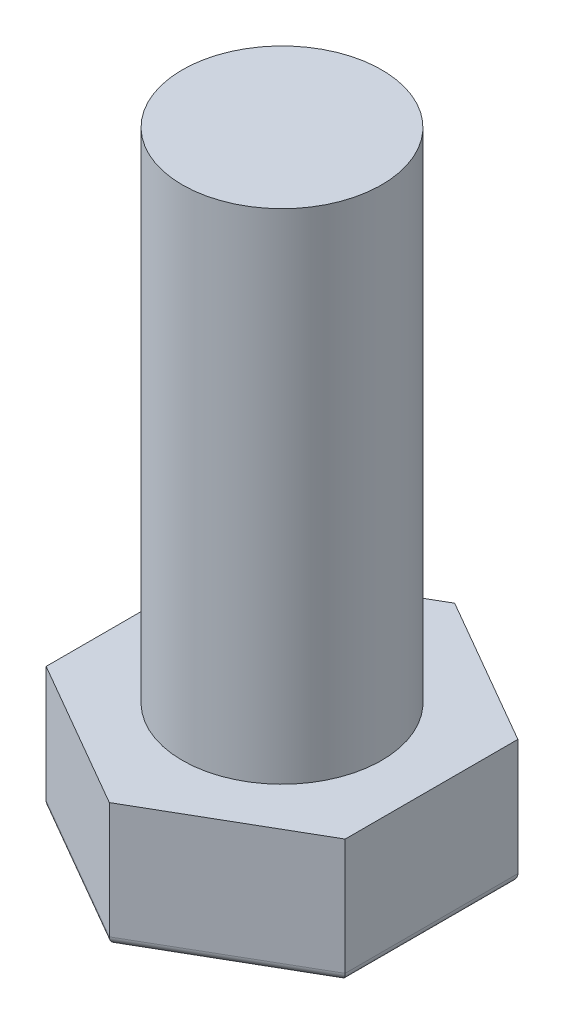
ISO-10303-21;
HEADER;
FILE_DESCRIPTION(('STEP AP214'),'2;1');
FILE_NAME('part.step','',(''),(''),'','','');
FILE_SCHEMA(('AUTOMOTIVE_DESIGN { 1 0 10303 214 1 1 1 1 }'));
ENDSEC;
DATA;
#1=APPLICATION_CONTEXT('core data for automotive mechanical design processes');
#2=APPLICATION_PROTOCOL_DEFINITION('international standard','automotive_design',2000,#1);
#3=PRODUCT_CONTEXT('',#1,'mechanical');
#4=PRODUCT('Part','Part','',(#3));
#5=PRODUCT_RELATED_PRODUCT_CATEGORY('part','',(#4));
#6=PRODUCT_DEFINITION_FORMATION('','',#4);
#7=PRODUCT_DEFINITION_CONTEXT('part definition',#1,'design');
#8=PRODUCT_DEFINITION('design','',#6,#7);
#9=PRODUCT_DEFINITION_SHAPE('','',#8);
#10=(LENGTH_UNIT() NAMED_UNIT(*) SI_UNIT(.MILLI.,.METRE.));
#11=(NAMED_UNIT(*) PLANE_ANGLE_UNIT() SI_UNIT($,.RADIAN.));
#12=(NAMED_UNIT(*) SI_UNIT($,.STERADIAN.) SOLID_ANGLE_UNIT());
#13=UNCERTAINTY_MEASURE_WITH_UNIT(LENGTH_MEASURE(1.E-05),#10,'distance_accuracy_value','');
#14=(GEOMETRIC_REPRESENTATION_CONTEXT(3) GLOBAL_UNCERTAINTY_ASSIGNED_CONTEXT((#13)) GLOBAL_UNIT_ASSIGNED_CONTEXT((#10,
#11,#12)) REPRESENTATION_CONTEXT('',''));
#15=CARTESIAN_POINT('',(0.,0.,0.));
#16=DIRECTION('',(0.,0.,1.));
#17=DIRECTION('',(1.,0.,0.));
#18=AXIS2_PLACEMENT_3D('',#15,#16,#17);
#19=CARTESIAN_POINT('',(18.,15.,-10.3923048454133));
#20=DIRECTION('',(-0.5,0.,0.866025403784439));
#21=DIRECTION('',(0.866025403784439,0.,0.5));
#22=AXIS2_PLACEMENT_3D('',#19,#20,#21);
#23=PLANE('',#22);
#24=DIRECTION('',(0.,-1.,0.));
#25=VECTOR('',#24,1.);
#26=CARTESIAN_POINT('',(18.,15.,-10.3923048454133));
#27=LINE('',#26,#25);
#28=CARTESIAN_POINT('',(18.,15.,-10.3923048454133));
#29=VERTEX_POINT('',#28);
#30=CARTESIAN_POINT('',(18.,1.,-10.3923048454133));
#31=VERTEX_POINT('',#30);
#32=EDGE_CURVE('E224',#29,#31,#27,.T.);
#33=ORIENTED_EDGE('',*,*,#32,.T.);
#34=DIRECTION('',(-0.866025403784439,0.,-0.5));
#35=VECTOR('',#34,1.);
#36=CARTESIAN_POINT('',(18.,1.,-10.3923048454133));
#37=LINE('',#36,#35);
#38=CARTESIAN_POINT('',(0.,1.,-20.7846096908265));
#39=VERTEX_POINT('',#38);
#40=EDGE_CURVE('E11',#31,#39,#37,.T.);
#41=ORIENTED_EDGE('',*,*,#40,.T.);
#42=DIRECTION('',(0.,-1.,0.));
#43=VECTOR('',#42,1.);
#44=CARTESIAN_POINT('',(0.,15.,-20.7846096908265));
#45=LINE('',#44,#43);
#46=CARTESIAN_POINT('',(0.,15.,-20.7846096908265));
#47=VERTEX_POINT('',#46);
#48=EDGE_CURVE('E121',#47,#39,#45,.T.);
#49=ORIENTED_EDGE('',*,*,#48,.F.);
#50=DIRECTION('',(-0.866025403784439,0.,-0.5));
#51=VECTOR('',#50,1.);
#52=CARTESIAN_POINT('',(18.,15.,-10.3923048454133));
#53=LINE('',#52,#51);
#54=EDGE_CURVE('E129',#29,#47,#53,.T.);
#55=ORIENTED_EDGE('',*,*,#54,.F.);
#56=EDGE_LOOP('',(#33,#41,#49,#55));
#57=FACE_BOUND('',#56,.T.);
#58=ADVANCED_FACE('F41',(#57),#23,.F.);
#59=CARTESIAN_POINT('',(0.,15.,-20.7846096908265));
#60=DIRECTION('',(0.5,0.,0.866025403784439));
#61=DIRECTION('',(0.866025403784439,0.,-0.5));
#62=AXIS2_PLACEMENT_3D('',#59,#60,#61);
#63=PLANE('',#62);
#64=ORIENTED_EDGE('',*,*,#48,.T.);
#65=DIRECTION('',(-0.866025403784439,0.,0.5));
#66=VECTOR('',#65,1.);
#67=CARTESIAN_POINT('',(0.,1.,-20.7846096908265));
#68=LINE('',#67,#66);
#69=CARTESIAN_POINT('',(-18.,1.,-10.3923048454133));
#70=VERTEX_POINT('',#69);
#71=EDGE_CURVE('E146',#39,#70,#68,.T.);
#72=ORIENTED_EDGE('',*,*,#71,.T.);
#73=DIRECTION('',(0.,-1.,0.));
#74=VECTOR('',#73,1.);
#75=CARTESIAN_POINT('',(-18.,15.,-10.3923048454133));
#76=LINE('',#75,#74);
#77=CARTESIAN_POINT('',(-18.,15.,-10.3923048454133));
#78=VERTEX_POINT('',#77);
#79=EDGE_CURVE('E124',#78,#70,#76,.T.);
#80=ORIENTED_EDGE('',*,*,#79,.F.);
#81=DIRECTION('',(-0.866025403784439,0.,0.5));
#82=VECTOR('',#81,1.);
#83=CARTESIAN_POINT('',(0.,15.,-20.7846096908265));
#84=LINE('',#83,#82);
#85=EDGE_CURVE('E116',#47,#78,#84,.T.);
#86=ORIENTED_EDGE('',*,*,#85,.F.);
#87=EDGE_LOOP('',(#64,#72,#80,#86));
#88=FACE_BOUND('',#87,.T.);
#89=ADVANCED_FACE('F118',(#88),#63,.F.);
#90=CARTESIAN_POINT('',(-18.,15.,-10.3923048454133));
#91=DIRECTION('',(1.,0.,0.));
#92=DIRECTION('',(0.,0.,-1.));
#93=AXIS2_PLACEMENT_3D('',#90,#91,#92);
#94=PLANE('',#93);
#95=ORIENTED_EDGE('',*,*,#79,.T.);
#96=DIRECTION('',(0.,0.,1.));
#97=VECTOR('',#96,1.);
#98=CARTESIAN_POINT('',(-18.,1.,-10.3923048454133));
#99=LINE('',#98,#97);
#100=CARTESIAN_POINT('',(-18.,1.,10.3923048454133));
#101=VERTEX_POINT('',#100);
#102=EDGE_CURVE('E173',#70,#101,#99,.T.);
#103=ORIENTED_EDGE('',*,*,#102,.T.);
#104=DIRECTION('',(0.,-1.,0.));
#105=VECTOR('',#104,1.);
#106=CARTESIAN_POINT('',(-18.,15.,10.3923048454133));
#107=LINE('',#106,#105);
#108=CARTESIAN_POINT('',(-18.,15.,10.3923048454133));
#109=VERTEX_POINT('',#108);
#110=EDGE_CURVE('E148',#109,#101,#107,.T.);
#111=ORIENTED_EDGE('',*,*,#110,.F.);
#112=DIRECTION('',(0.,0.,1.));
#113=VECTOR('',#112,1.);
#114=CARTESIAN_POINT('',(-18.,15.,-10.3923048454133));
#115=LINE('',#114,#113);
#116=EDGE_CURVE('E128',#78,#109,#115,.T.);
#117=ORIENTED_EDGE('',*,*,#116,.F.);
#118=EDGE_LOOP('',(#95,#103,#111,#117));
#119=FACE_BOUND('',#118,.T.);
#120=ADVANCED_FACE('F272',(#119),#94,.F.);
#121=CARTESIAN_POINT('',(-18.,15.,10.3923048454133));
#122=DIRECTION('',(0.5,0.,-0.866025403784438));
#123=DIRECTION('',(-0.866025403784439,0.,-0.5));
#124=AXIS2_PLACEMENT_3D('',#121,#122,#123);
#125=PLANE('',#124);
#126=ORIENTED_EDGE('',*,*,#110,.T.);
#127=DIRECTION('',(0.866025403784439,0.,0.5));
#128=VECTOR('',#127,1.);
#129=CARTESIAN_POINT('',(-18.,1.,10.3923048454133));
#130=LINE('',#129,#128);
#131=CARTESIAN_POINT('',(0.,1.,20.7846096908265));
#132=VERTEX_POINT('',#131);
#133=EDGE_CURVE('E176',#101,#132,#130,.T.);
#134=ORIENTED_EDGE('',*,*,#133,.T.);
#135=DIRECTION('',(0.,-1.,0.));
#136=VECTOR('',#135,1.);
#137=CARTESIAN_POINT('',(0.,15.,20.7846096908265));
#138=LINE('',#137,#136);
#139=CARTESIAN_POINT('',(0.,15.,20.7846096908265));
#140=VERTEX_POINT('',#139);
#141=EDGE_CURVE('E230',#140,#132,#138,.T.);
#142=ORIENTED_EDGE('',*,*,#141,.F.);
#143=DIRECTION('',(0.866025403784438,0.,0.5));
#144=VECTOR('',#143,1.);
#145=CARTESIAN_POINT('',(-18.,15.,10.3923048454133));
#146=LINE('',#145,#144);
#147=EDGE_CURVE('E216',#109,#140,#146,.T.);
#148=ORIENTED_EDGE('',*,*,#147,.F.);
#149=EDGE_LOOP('',(#126,#134,#142,#148));
#150=FACE_BOUND('',#149,.T.);
#151=ADVANCED_FACE('F237',(#150),#125,.F.);
#152=CARTESIAN_POINT('',(0.,15.,20.7846096908265));
#153=DIRECTION('',(-0.5,0.,-0.866025403784439));
#154=DIRECTION('',(-0.866025403784439,0.,0.5));
#155=AXIS2_PLACEMENT_3D('',#152,#153,#154);
#156=PLANE('',#155);
#157=ORIENTED_EDGE('',*,*,#141,.T.);
#158=DIRECTION('',(0.866025403784439,0.,-0.5));
#159=VECTOR('',#158,1.);
#160=CARTESIAN_POINT('',(0.,1.,20.7846096908265));
#161=LINE('',#160,#159);
#162=CARTESIAN_POINT('',(18.,1.,10.3923048454133));
#163=VERTEX_POINT('',#162);
#164=EDGE_CURVE('E66',#132,#163,#161,.T.);
#165=ORIENTED_EDGE('',*,*,#164,.T.);
#166=DIRECTION('',(0.,-1.,0.));
#167=VECTOR('',#166,1.);
#168=CARTESIAN_POINT('',(18.,15.,10.3923048454133));
#169=LINE('',#168,#167);
#170=CARTESIAN_POINT('',(18.,15.,10.3923048454133));
#171=VERTEX_POINT('',#170);
#172=EDGE_CURVE('E227',#171,#163,#169,.T.);
#173=ORIENTED_EDGE('',*,*,#172,.F.);
#174=DIRECTION('',(0.866025403784439,0.,-0.5));
#175=VECTOR('',#174,1.);
#176=CARTESIAN_POINT('',(0.,15.,20.7846096908265));
#177=LINE('',#176,#175);
#178=EDGE_CURVE('E219',#140,#171,#177,.T.);
#179=ORIENTED_EDGE('',*,*,#178,.F.);
#180=EDGE_LOOP('',(#157,#165,#173,#179));
#181=FACE_BOUND('',#180,.T.);
#182=ADVANCED_FACE('F353',(#181),#156,.F.);
#183=CARTESIAN_POINT('',(18.,15.,10.3923048454133));
#184=DIRECTION('',(-1.,0.,0.));
#185=DIRECTION('',(0.,0.,1.));
#186=AXIS2_PLACEMENT_3D('',#183,#184,#185);
#187=PLANE('',#186);
#188=ORIENTED_EDGE('',*,*,#172,.T.);
#189=DIRECTION('',(0.,0.,-1.));
#190=VECTOR('',#189,1.);
#191=CARTESIAN_POINT('',(18.,1.,10.3923048454133));
#192=LINE('',#191,#190);
#193=EDGE_CURVE('E51',#163,#31,#192,.T.);
#194=ORIENTED_EDGE('',*,*,#193,.T.);
#195=ORIENTED_EDGE('',*,*,#32,.F.);
#196=DIRECTION('',(0.,0.,-1.));
#197=VECTOR('',#196,1.);
#198=CARTESIAN_POINT('',(18.,15.,10.3923048454133));
#199=LINE('',#198,#197);
#200=EDGE_CURVE('E134',#171,#29,#199,.T.);
#201=ORIENTED_EDGE('',*,*,#200,.F.);
#202=EDGE_LOOP('',(#188,#194,#195,#201));
#203=FACE_BOUND('',#202,.T.);
#204=ADVANCED_FACE('F345',(#203),#187,.F.);
#205=CARTESIAN_POINT('',(0.,15.,0.));
#206=DIRECTION('',(0.,1.,0.));
#207=DIRECTION('',(0.,0.,1.));
#208=AXIS2_PLACEMENT_3D('',#205,#206,#207);
#209=PLANE('',#208);
#210=CARTESIAN_POINT('',(0.,15.,0.));
#211=DIRECTION('',(0.,1.,0.));
#212=DIRECTION('',(0.,0.,1.));
#213=AXIS2_PLACEMENT_3D('',#210,#211,#212);
#214=CIRCLE('',#213,12.);
#215=CARTESIAN_POINT('',(0.,15.,12.));
#216=VERTEX_POINT('',#215);
#217=EDGE_CURVE('E141',#216,#216,#214,.T.);
#218=ORIENTED_EDGE('',*,*,#217,.F.);
#219=EDGE_LOOP('',(#218));
#220=FACE_BOUND('',#219,.T.);
#221=ORIENTED_EDGE('',*,*,#54,.T.);
#222=ORIENTED_EDGE('',*,*,#85,.T.);
#223=ORIENTED_EDGE('',*,*,#116,.T.);
#224=ORIENTED_EDGE('',*,*,#147,.T.);
#225=ORIENTED_EDGE('',*,*,#178,.T.);
#226=ORIENTED_EDGE('',*,*,#200,.T.);
#227=EDGE_LOOP('',(#221,#222,#223,#224,#225,#226));
#228=FACE_BOUND('',#227,.T.);
#229=ADVANCED_FACE('F132',(#220,#228),#209,.T.);
#230=CARTESIAN_POINT('',(0.,0.,0.));
#231=DIRECTION('',(0.,1.,0.));
#232=DIRECTION('',(0.,0.,1.));
#233=AXIS2_PLACEMENT_3D('',#230,#231,#232);
#234=PLANE('',#233);
#235=DIRECTION('',(0.,0.,1.));
#236=VECTOR('',#235,1.);
#237=CARTESIAN_POINT('',(-17.,0.,0.));
#238=LINE('',#237,#236);
#239=CARTESIAN_POINT('',(-17.,0.,9.81495457622363));
#240=VERTEX_POINT('',#239);
#241=CARTESIAN_POINT('',(-17.,0.,-9.81495457622364));
#242=VERTEX_POINT('',#241);
#243=EDGE_CURVE('E166',#240,#242,#238,.F.);
#244=ORIENTED_EDGE('',*,*,#243,.T.);
#245=DIRECTION('',(-0.866025403784439,0.,0.5));
#246=VECTOR('',#245,1.);
#247=CARTESIAN_POINT('',(-8.5,0.,-14.7224318643355));
#248=LINE('',#247,#246);
#249=CARTESIAN_POINT('',(0.,0.,-19.6299091524473));
#250=VERTEX_POINT('',#249);
#251=EDGE_CURVE('E169',#242,#250,#248,.F.);
#252=ORIENTED_EDGE('',*,*,#251,.T.);
#253=DIRECTION('',(-0.866025403784439,0.,-0.5));
#254=VECTOR('',#253,1.);
#255=CARTESIAN_POINT('',(8.5,0.,-14.7224318643355));
#256=LINE('',#255,#254);
#257=CARTESIAN_POINT('',(17.,0.,-9.81495457622364));
#258=VERTEX_POINT('',#257);
#259=EDGE_CURVE('E154',#250,#258,#256,.F.);
#260=ORIENTED_EDGE('',*,*,#259,.T.);
#261=DIRECTION('',(0.,0.,-1.));
#262=VECTOR('',#261,1.);
#263=CARTESIAN_POINT('',(17.,0.,0.));
#264=LINE('',#263,#262);
#265=CARTESIAN_POINT('',(17.,0.,9.81495457622363));
#266=VERTEX_POINT('',#265);
#267=EDGE_CURVE('E157',#258,#266,#264,.F.);
#268=ORIENTED_EDGE('',*,*,#267,.T.);
#269=DIRECTION('',(0.866025403784439,0.,-0.5));
#270=VECTOR('',#269,1.);
#271=CARTESIAN_POINT('',(8.5,0.,14.7224318643355));
#272=LINE('',#271,#270);
#273=CARTESIAN_POINT('',(0.,0.,19.6299091524473));
#274=VERTEX_POINT('',#273);
#275=EDGE_CURVE('E160',#266,#274,#272,.F.);
#276=ORIENTED_EDGE('',*,*,#275,.T.);
#277=DIRECTION('',(0.866025403784439,0.,0.5));
#278=VECTOR('',#277,1.);
#279=CARTESIAN_POINT('',(-8.50000000000001,0.,14.7224318643355));
#280=LINE('',#279,#278);
#281=EDGE_CURVE('E163',#274,#240,#280,.F.);
#282=ORIENTED_EDGE('',*,*,#281,.T.);
#283=EDGE_LOOP('',(#244,#252,#260,#268,#276,#282));
#284=FACE_BOUND('',#283,.T.);
#285=ADVANCED_FACE('F249',(#284),#234,.F.);
#286=CARTESIAN_POINT('',(0.,75.,0.));
#287=DIRECTION('',(0.,-1.,0.));
#288=DIRECTION('',(0.,0.,-1.));
#289=AXIS2_PLACEMENT_3D('',#286,#287,#288);
#290=CYLINDRICAL_SURFACE('',#289,12.);
#291=CARTESIAN_POINT('',(0.,75.,0.));
#292=DIRECTION('',(0.,1.,0.));
#293=DIRECTION('',(0.,0.,1.));
#294=AXIS2_PLACEMENT_3D('',#291,#292,#293);
#295=CIRCLE('',#294,12.);
#296=CARTESIAN_POINT('',(0.,75.,12.));
#297=VERTEX_POINT('',#296);
#298=EDGE_CURVE('E137',#297,#297,#295,.T.);
#299=ORIENTED_EDGE('',*,*,#298,.F.);
#300=EDGE_LOOP('',(#299));
#301=FACE_BOUND('',#300,.T.);
#302=ORIENTED_EDGE('',*,*,#217,.T.);
#303=EDGE_LOOP('',(#302));
#304=FACE_BOUND('',#303,.T.);
#305=ADVANCED_FACE('F321',(#301,#304),#290,.T.);
#306=CARTESIAN_POINT('',(0.,75.,0.));
#307=DIRECTION('',(0.,1.,0.));
#308=DIRECTION('',(0.,0.,1.));
#309=AXIS2_PLACEMENT_3D('',#306,#307,#308);
#310=PLANE('',#309);
#311=ORIENTED_EDGE('',*,*,#298,.T.);
#312=EDGE_LOOP('',(#311));
#313=FACE_BOUND('',#312,.T.);
#314=ADVANCED_FACE('F265',(#313),#310,.T.);
#315=CARTESIAN_POINT('',(-0.500000000000008,1.,19.9185842870421));
#316=DIRECTION('',(0.866025403784439,0.,-0.5));
#317=DIRECTION('',(-0.5,0.,-0.866025403784439));
#318=AXIS2_PLACEMENT_3D('',#315,#316,#317);
#319=CYLINDRICAL_SURFACE('',#318,1.);
#320=CARTESIAN_POINT('',(0.,1.,19.6299091524473));
#321=DIRECTION('',(1.,0.,0.));
#322=DIRECTION('',(0.,0.,-1.));
#323=AXIS2_PLACEMENT_3D('',#320,#321,#322);
#324=ELLIPSE('',#323,1.15470053837925,1.);
#325=EDGE_CURVE('E196',#274,#132,#324,.F.);
#326=ORIENTED_EDGE('',*,*,#325,.F.);
#327=ORIENTED_EDGE('',*,*,#275,.F.);
#328=CARTESIAN_POINT('',(17.,1.,9.81495457622363));
#329=DIRECTION('',(0.5,0.,-0.866025403784439));
#330=DIRECTION('',(-0.866025403784439,0.,-0.5));
#331=AXIS2_PLACEMENT_3D('',#328,#329,#330);
#332=ELLIPSE('',#331,1.15470053837925,1.);
#333=EDGE_CURVE('E45',#163,#266,#332,.T.);
#334=ORIENTED_EDGE('',*,*,#333,.F.);
#335=ORIENTED_EDGE('',*,*,#164,.F.);
#336=EDGE_LOOP('',(#326,#327,#334,#335));
#337=FACE_BOUND('',#336,.T.);
#338=ADVANCED_FACE('F43',(#337),#319,.T.);
#339=CARTESIAN_POINT('',(17.,1.,10.3923048454133));
#340=DIRECTION('',(0.,0.,-1.));
#341=DIRECTION('',(-1.,0.,0.));
#342=AXIS2_PLACEMENT_3D('',#339,#340,#341);
#343=CYLINDRICAL_SURFACE('',#342,1.);
#344=ORIENTED_EDGE('',*,*,#333,.T.);
#345=ORIENTED_EDGE('',*,*,#267,.F.);
#346=CARTESIAN_POINT('',(17.,1.,-9.81495457622364));
#347=DIRECTION('',(-0.5,0.,-0.866025403784439));
#348=DIRECTION('',(-0.866025403784439,0.,0.5));
#349=AXIS2_PLACEMENT_3D('',#346,#347,#348);
#350=ELLIPSE('',#349,1.15470053837925,1.);
#351=EDGE_CURVE('E193',#31,#258,#350,.T.);
#352=ORIENTED_EDGE('',*,*,#351,.F.);
#353=ORIENTED_EDGE('',*,*,#193,.F.);
#354=EDGE_LOOP('',(#344,#345,#352,#353));
#355=FACE_BOUND('',#354,.T.);
#356=ADVANCED_FACE('F258',(#355),#343,.T.);
#357=CARTESIAN_POINT('',(-17.5,1.,9.52627944162882));
#358=DIRECTION('',(0.866025403784439,0.,0.5));
#359=DIRECTION('',(0.5,0.,-0.866025403784438));
#360=AXIS2_PLACEMENT_3D('',#357,#358,#359);
#361=CYLINDRICAL_SURFACE('',#360,1.);
#362=ORIENTED_EDGE('',*,*,#325,.T.);
#363=ORIENTED_EDGE('',*,*,#133,.F.);
#364=CARTESIAN_POINT('',(-17.,1.,9.81495457622363));
#365=DIRECTION('',(0.5,0.,0.866025403784439));
#366=DIRECTION('',(0.866025403784439,0.,-0.5));
#367=AXIS2_PLACEMENT_3D('',#364,#365,#366);
#368=ELLIPSE('',#367,1.15470053837925,1.);
#369=EDGE_CURVE('E189',#240,#101,#368,.F.);
#370=ORIENTED_EDGE('',*,*,#369,.F.);
#371=ORIENTED_EDGE('',*,*,#281,.F.);
#372=EDGE_LOOP('',(#362,#363,#370,#371));
#373=FACE_BOUND('',#372,.T.);
#374=ADVANCED_FACE('F241',(#373),#361,.T.);
#375=CARTESIAN_POINT('',(17.5,1.,-9.52627944162883));
#376=DIRECTION('',(-0.866025403784439,0.,-0.5));
#377=DIRECTION('',(-0.5,0.,0.866025403784439));
#378=AXIS2_PLACEMENT_3D('',#375,#376,#377);
#379=CYLINDRICAL_SURFACE('',#378,1.);
#380=ORIENTED_EDGE('',*,*,#351,.T.);
#381=ORIENTED_EDGE('',*,*,#259,.F.);
#382=CARTESIAN_POINT('',(0.,1.,-19.6299091524473));
#383=DIRECTION('',(-1.,0.,0.));
#384=DIRECTION('',(0.,0.,-1.));
#385=AXIS2_PLACEMENT_3D('',#382,#383,#384);
#386=ELLIPSE('',#385,1.15470053837925,1.);
#387=EDGE_CURVE('E186',#39,#250,#386,.T.);
#388=ORIENTED_EDGE('',*,*,#387,.F.);
#389=ORIENTED_EDGE('',*,*,#40,.F.);
#390=EDGE_LOOP('',(#380,#381,#388,#389));
#391=FACE_BOUND('',#390,.T.);
#392=ADVANCED_FACE('F255',(#391),#379,.T.);
#393=CARTESIAN_POINT('',(-17.,1.,-10.3923048454133));
#394=DIRECTION('',(0.,0.,1.));
#395=DIRECTION('',(1.,0.,0.));
#396=AXIS2_PLACEMENT_3D('',#393,#394,#395);
#397=CYLINDRICAL_SURFACE('',#396,1.);
#398=ORIENTED_EDGE('',*,*,#369,.T.);
#399=ORIENTED_EDGE('',*,*,#102,.F.);
#400=CARTESIAN_POINT('',(-17.,1.,-9.81495457622363));
#401=DIRECTION('',(-0.5,0.,0.866025403784438));
#402=DIRECTION('',(0.866025403784439,0.,0.5));
#403=AXIS2_PLACEMENT_3D('',#400,#401,#402);
#404=ELLIPSE('',#403,1.15470053837925,1.);
#405=EDGE_CURVE('E183',#242,#70,#404,.F.);
#406=ORIENTED_EDGE('',*,*,#405,.F.);
#407=ORIENTED_EDGE('',*,*,#243,.F.);
#408=EDGE_LOOP('',(#398,#399,#406,#407));
#409=FACE_BOUND('',#408,.T.);
#410=ADVANCED_FACE('F245',(#409),#397,.T.);
#411=CARTESIAN_POINT('',(0.5,1.,-19.9185842870421));
#412=DIRECTION('',(-0.866025403784439,0.,0.5));
#413=DIRECTION('',(0.5,0.,0.866025403784439));
#414=AXIS2_PLACEMENT_3D('',#411,#412,#413);
#415=CYLINDRICAL_SURFACE('',#414,1.);
#416=ORIENTED_EDGE('',*,*,#387,.T.);
#417=ORIENTED_EDGE('',*,*,#251,.F.);
#418=ORIENTED_EDGE('',*,*,#405,.T.);
#419=ORIENTED_EDGE('',*,*,#71,.F.);
#420=EDGE_LOOP('',(#416,#417,#418,#419));
#421=FACE_BOUND('',#420,.T.);
#422=ADVANCED_FACE('F251',(#421),#415,.T.);
#423=CLOSED_SHELL('',(#58,#89,#120,#151,#182,#204,#229,#285,#305,#314,#338,#356,#374,#392,#410,#422));
#424=MANIFOLD_SOLID_BREP('B2',#423);
#425=ADVANCED_BREP_SHAPE_REPRESENTATION('',(#18,#424),#14);
#426=SHAPE_DEFINITION_REPRESENTATION(#9,#425);
ENDSEC;
END-ISO-10303-21;
